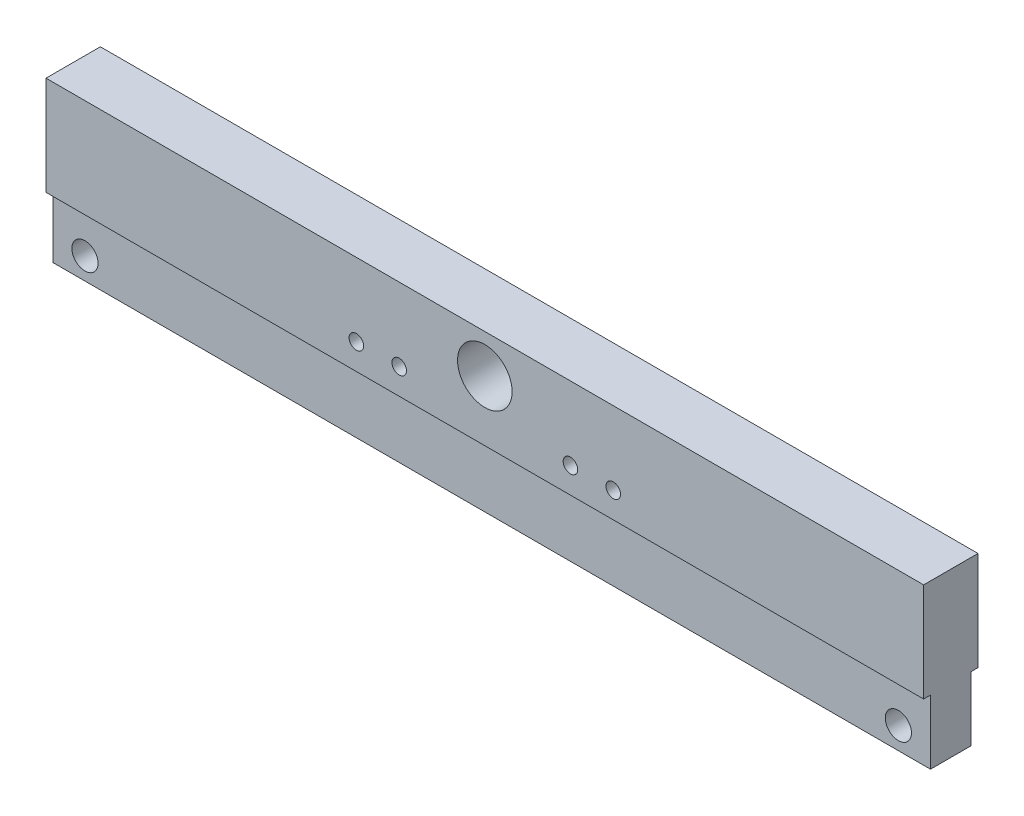
ISO-10303-21;
HEADER;
FILE_DESCRIPTION(('STEP AP214'),'2;1');
FILE_NAME('part.step','',(''),(''),'','','');
FILE_SCHEMA(('AUTOMOTIVE_DESIGN { 1 0 10303 214 1 1 1 1 }'));
ENDSEC;
DATA;
#1=APPLICATION_CONTEXT('core data for automotive mechanical design processes');
#2=APPLICATION_PROTOCOL_DEFINITION('international standard','automotive_design',2000,#1);
#3=PRODUCT_CONTEXT('',#1,'mechanical');
#4=PRODUCT('Part','Part','',(#3));
#5=PRODUCT_RELATED_PRODUCT_CATEGORY('part','',(#4));
#6=PRODUCT_DEFINITION_FORMATION('','',#4);
#7=PRODUCT_DEFINITION_CONTEXT('part definition',#1,'design');
#8=PRODUCT_DEFINITION('design','',#6,#7);
#9=PRODUCT_DEFINITION_SHAPE('','',#8);
#10=(LENGTH_UNIT() NAMED_UNIT(*) SI_UNIT(.MILLI.,.METRE.));
#11=(NAMED_UNIT(*) PLANE_ANGLE_UNIT() SI_UNIT($,.RADIAN.));
#12=(NAMED_UNIT(*) SI_UNIT($,.STERADIAN.) SOLID_ANGLE_UNIT());
#13=UNCERTAINTY_MEASURE_WITH_UNIT(LENGTH_MEASURE(1.E-05),#10,'distance_accuracy_value','');
#14=(GEOMETRIC_REPRESENTATION_CONTEXT(3) GLOBAL_UNCERTAINTY_ASSIGNED_CONTEXT((#13)) GLOBAL_UNIT_ASSIGNED_CONTEXT((#10,
#11,#12)) REPRESENTATION_CONTEXT('',''));
#15=CARTESIAN_POINT('',(0.,0.,0.));
#16=DIRECTION('',(0.,0.,1.));
#17=DIRECTION('',(1.,0.,0.));
#18=AXIS2_PLACEMENT_3D('',#15,#16,#17);
#19=CARTESIAN_POINT('',(0.,0.,12.7));
#20=DIRECTION('',(0.,0.,1.));
#21=DIRECTION('',(1.,0.,0.));
#22=AXIS2_PLACEMENT_3D('',#19,#20,#21);
#23=PLANE('',#22);
#24=CARTESIAN_POINT('',(-60.,3.9,12.7));
#25=DIRECTION('',(0.,0.,1.));
#26=DIRECTION('',(1.,0.,0.));
#27=AXIS2_PLACEMENT_3D('',#24,#25,#26);
#28=CIRCLE('',#27,3.39999999999999);
#29=CARTESIAN_POINT('',(-56.6,3.9,12.7));
#30=VERTEX_POINT('',#29);
#31=EDGE_CURVE('E207',#30,#30,#28,.T.);
#32=ORIENTED_EDGE('',*,*,#31,.F.);
#33=EDGE_LOOP('',(#32));
#34=FACE_BOUND('',#33,.T.);
#35=CARTESIAN_POINT('',(-40.,3.9,12.7));
#36=DIRECTION('',(0.,0.,1.));
#37=DIRECTION('',(1.,0.,0.));
#38=AXIS2_PLACEMENT_3D('',#35,#36,#37);
#39=CIRCLE('',#38,3.39999999999999);
#40=CARTESIAN_POINT('',(-36.6,3.9,12.7));
#41=VERTEX_POINT('',#40);
#42=EDGE_CURVE('E199',#41,#41,#39,.T.);
#43=ORIENTED_EDGE('',*,*,#42,.F.);
#44=EDGE_LOOP('',(#43));
#45=FACE_BOUND('',#44,.T.);
#46=CARTESIAN_POINT('',(40.,3.9,12.7));
#47=DIRECTION('',(0.,0.,1.));
#48=DIRECTION('',(1.,0.,0.));
#49=AXIS2_PLACEMENT_3D('',#46,#47,#48);
#50=CIRCLE('',#49,3.39999999999999);
#51=CARTESIAN_POINT('',(43.4,3.9,12.7));
#52=VERTEX_POINT('',#51);
#53=EDGE_CURVE('E191',#52,#52,#50,.T.);
#54=ORIENTED_EDGE('',*,*,#53,.F.);
#55=EDGE_LOOP('',(#54));
#56=FACE_BOUND('',#55,.T.);
#57=CARTESIAN_POINT('',(60.,3.9,12.7));
#58=DIRECTION('',(0.,0.,1.));
#59=DIRECTION('',(1.,0.,0.));
#60=AXIS2_PLACEMENT_3D('',#57,#58,#59);
#61=CIRCLE('',#60,3.39999999999999);
#62=CARTESIAN_POINT('',(63.4,3.9,12.7));
#63=VERTEX_POINT('',#62);
#64=EDGE_CURVE('E183',#63,#63,#61,.T.);
#65=ORIENTED_EDGE('',*,*,#64,.F.);
#66=EDGE_LOOP('',(#65));
#67=FACE_BOUND('',#66,.T.);
#68=CARTESIAN_POINT('',(0.,20.1,12.7));
#69=DIRECTION('',(0.,0.,1.));
#70=DIRECTION('',(1.,0.,0.));
#71=AXIS2_PLACEMENT_3D('',#68,#69,#70);
#72=CIRCLE('',#71,12.75);
#73=CARTESIAN_POINT('',(12.75,20.1,12.7));
#74=VERTEX_POINT('',#73);
#75=EDGE_CURVE('E226',#74,#74,#72,.T.);
#76=ORIENTED_EDGE('',*,*,#75,.F.);
#77=EDGE_LOOP('',(#76));
#78=FACE_BOUND('',#77,.T.);
#79=DIRECTION('',(0.,-1.,0.));
#80=VECTOR('',#79,1.);
#81=CARTESIAN_POINT('',(-205.,38.1,12.7));
#82=LINE('',#81,#80);
#83=CARTESIAN_POINT('',(-205.,38.1,12.7));
#84=VERTEX_POINT('',#83);
#85=CARTESIAN_POINT('',(-205.,-8.1,12.7));
#86=VERTEX_POINT('',#85);
#87=EDGE_CURVE('E228',#84,#86,#82,.T.);
#88=ORIENTED_EDGE('',*,*,#87,.T.);
#89=DIRECTION('',(1.,0.,0.));
#90=VECTOR('',#89,1.);
#91=CARTESIAN_POINT('',(0.,-8.1,12.7));
#92=LINE('',#91,#90);
#93=CARTESIAN_POINT('',(205.,-8.1,12.7));
#94=VERTEX_POINT('',#93);
#95=EDGE_CURVE('E144',#86,#94,#92,.T.);
#96=ORIENTED_EDGE('',*,*,#95,.T.);
#97=DIRECTION('',(0.,1.,0.));
#98=VECTOR('',#97,1.);
#99=CARTESIAN_POINT('',(205.,38.1,12.7));
#100=LINE('',#99,#98);
#101=CARTESIAN_POINT('',(205.,38.1,12.7));
#102=VERTEX_POINT('',#101);
#103=EDGE_CURVE('E233',#94,#102,#100,.T.);
#104=ORIENTED_EDGE('',*,*,#103,.T.);
#105=DIRECTION('',(-1.,0.,0.));
#106=VECTOR('',#105,1.);
#107=CARTESIAN_POINT('',(-205.,38.1,12.7));
#108=LINE('',#107,#106);
#109=EDGE_CURVE('E230',#102,#84,#108,.T.);
#110=ORIENTED_EDGE('',*,*,#109,.T.);
#111=EDGE_LOOP('',(#88,#96,#104,#110));
#112=FACE_BOUND('',#111,.T.);
#113=ADVANCED_FACE('F43',(#34,#45,#56,#67,#78,#112),#23,.T.);
#114=CARTESIAN_POINT('',(0.,0.,-12.7));
#115=DIRECTION('',(0.,0.,1.));
#116=DIRECTION('',(1.,0.,0.));
#117=AXIS2_PLACEMENT_3D('',#114,#115,#116);
#118=PLANE('',#117);
#119=CARTESIAN_POINT('',(-60.,3.9,-12.7));
#120=DIRECTION('',(0.,0.,1.));
#121=DIRECTION('',(1.,0.,0.));
#122=AXIS2_PLACEMENT_3D('',#119,#120,#121);
#123=CIRCLE('',#122,3.39999999999999);
#124=CARTESIAN_POINT('',(-56.6,3.9,-12.7));
#125=VERTEX_POINT('',#124);
#126=EDGE_CURVE('E203',#125,#125,#123,.T.);
#127=ORIENTED_EDGE('',*,*,#126,.T.);
#128=EDGE_LOOP('',(#127));
#129=FACE_BOUND('',#128,.T.);
#130=CARTESIAN_POINT('',(-40.,3.9,-12.7));
#131=DIRECTION('',(0.,0.,1.));
#132=DIRECTION('',(1.,0.,0.));
#133=AXIS2_PLACEMENT_3D('',#130,#131,#132);
#134=CIRCLE('',#133,3.39999999999999);
#135=CARTESIAN_POINT('',(-36.6,3.9,-12.7));
#136=VERTEX_POINT('',#135);
#137=EDGE_CURVE('E195',#136,#136,#134,.T.);
#138=ORIENTED_EDGE('',*,*,#137,.T.);
#139=EDGE_LOOP('',(#138));
#140=FACE_BOUND('',#139,.T.);
#141=CARTESIAN_POINT('',(40.,3.9,-12.7));
#142=DIRECTION('',(0.,0.,1.));
#143=DIRECTION('',(1.,0.,0.));
#144=AXIS2_PLACEMENT_3D('',#141,#142,#143);
#145=CIRCLE('',#144,3.39999999999999);
#146=CARTESIAN_POINT('',(43.4,3.9,-12.7));
#147=VERTEX_POINT('',#146);
#148=EDGE_CURVE('E187',#147,#147,#145,.T.);
#149=ORIENTED_EDGE('',*,*,#148,.T.);
#150=EDGE_LOOP('',(#149));
#151=FACE_BOUND('',#150,.T.);
#152=CARTESIAN_POINT('',(60.,3.9,-12.7));
#153=DIRECTION('',(0.,0.,1.));
#154=DIRECTION('',(1.,0.,0.));
#155=AXIS2_PLACEMENT_3D('',#152,#153,#154);
#156=CIRCLE('',#155,3.4);
#157=CARTESIAN_POINT('',(63.4,3.9,-12.7));
#158=VERTEX_POINT('',#157);
#159=EDGE_CURVE('E177',#158,#158,#156,.T.);
#160=ORIENTED_EDGE('',*,*,#159,.T.);
#161=EDGE_LOOP('',(#160));
#162=FACE_BOUND('',#161,.T.);
#163=CARTESIAN_POINT('',(0.,20.1,-12.7));
#164=DIRECTION('',(0.,0.,1.));
#165=DIRECTION('',(1.,0.,0.));
#166=AXIS2_PLACEMENT_3D('',#163,#164,#165);
#167=CIRCLE('',#166,12.75);
#168=CARTESIAN_POINT('',(12.75,20.1,-12.7));
#169=VERTEX_POINT('',#168);
#170=EDGE_CURVE('E242',#169,#169,#167,.T.);
#171=ORIENTED_EDGE('',*,*,#170,.T.);
#172=EDGE_LOOP('',(#171));
#173=FACE_BOUND('',#172,.T.);
#174=DIRECTION('',(1.,0.,0.));
#175=VECTOR('',#174,1.);
#176=CARTESIAN_POINT('',(0.,-8.1,-12.7));
#177=LINE('',#176,#175);
#178=CARTESIAN_POINT('',(-205.,-8.1,-12.7));
#179=VERTEX_POINT('',#178);
#180=CARTESIAN_POINT('',(205.,-8.1,-12.7));
#181=VERTEX_POINT('',#180);
#182=EDGE_CURVE('E133',#179,#181,#177,.T.);
#183=ORIENTED_EDGE('',*,*,#182,.F.);
#184=DIRECTION('',(0.,-1.,0.));
#185=VECTOR('',#184,1.);
#186=CARTESIAN_POINT('',(-205.,38.1,-12.7));
#187=LINE('',#186,#185);
#188=CARTESIAN_POINT('',(-205.,38.1,-12.7));
#189=VERTEX_POINT('',#188);
#190=EDGE_CURVE('E130',#189,#179,#187,.T.);
#191=ORIENTED_EDGE('',*,*,#190,.F.);
#192=DIRECTION('',(-1.,0.,0.));
#193=VECTOR('',#192,1.);
#194=CARTESIAN_POINT('',(-205.,38.1,-12.7));
#195=LINE('',#194,#193);
#196=CARTESIAN_POINT('',(205.,38.1,-12.7));
#197=VERTEX_POINT('',#196);
#198=EDGE_CURVE('E234',#197,#189,#195,.T.);
#199=ORIENTED_EDGE('',*,*,#198,.F.);
#200=DIRECTION('',(0.,1.,0.));
#201=VECTOR('',#200,1.);
#202=CARTESIAN_POINT('',(205.,38.1,-12.7));
#203=LINE('',#202,#201);
#204=EDGE_CURVE('E239',#181,#197,#203,.T.);
#205=ORIENTED_EDGE('',*,*,#204,.F.);
#206=EDGE_LOOP('',(#183,#191,#199,#205));
#207=FACE_BOUND('',#206,.T.);
#208=ADVANCED_FACE('F216',(#129,#140,#151,#162,#173,#207),#118,.F.);
#209=CARTESIAN_POINT('',(-205.,38.1,12.7));
#210=DIRECTION('',(1.,0.,0.));
#211=DIRECTION('',(0.,0.,-1.));
#212=AXIS2_PLACEMENT_3D('',#209,#210,#211);
#213=PLANE('',#212);
#214=DIRECTION('',(0.,-1.,0.));
#215=VECTOR('',#214,1.);
#216=CARTESIAN_POINT('',(-205.,-8.1,9.50000000000001));
#217=LINE('',#216,#215);
#218=CARTESIAN_POINT('',(-205.,-8.1,9.50000000000001));
#219=VERTEX_POINT('',#218);
#220=CARTESIAN_POINT('',(-205.,-38.1,9.50000000000001));
#221=VERTEX_POINT('',#220);
#222=EDGE_CURVE('E170',#219,#221,#217,.T.);
#223=ORIENTED_EDGE('',*,*,#222,.F.);
#224=DIRECTION('',(0.,0.,-1.));
#225=VECTOR('',#224,1.);
#226=CARTESIAN_POINT('',(-205.,-8.1,12.7));
#227=LINE('',#226,#225);
#228=EDGE_CURVE('E135',#86,#219,#227,.T.);
#229=ORIENTED_EDGE('',*,*,#228,.F.);
#230=ORIENTED_EDGE('',*,*,#87,.F.);
#231=DIRECTION('',(0.,0.,-1.));
#232=VECTOR('',#231,1.);
#233=CARTESIAN_POINT('',(-205.,38.1,12.7));
#234=LINE('',#233,#232);
#235=EDGE_CURVE('E247',#84,#189,#234,.T.);
#236=ORIENTED_EDGE('',*,*,#235,.T.);
#237=ORIENTED_EDGE('',*,*,#190,.T.);
#238=CARTESIAN_POINT('',(-205.,-8.1,-9.49999999999999));
#239=VERTEX_POINT('',#238);
#240=EDGE_CURVE('E120',#239,#179,#227,.T.);
#241=ORIENTED_EDGE('',*,*,#240,.F.);
#242=DIRECTION('',(0.,-1.,0.));
#243=VECTOR('',#242,1.);
#244=CARTESIAN_POINT('',(-205.,-8.1,-9.49999999999999));
#245=LINE('',#244,#243);
#246=CARTESIAN_POINT('',(-205.,-38.1,-9.49999999999999));
#247=VERTEX_POINT('',#246);
#248=EDGE_CURVE('E106',#239,#247,#245,.T.);
#249=ORIENTED_EDGE('',*,*,#248,.T.);
#250=DIRECTION('',(0.,0.,-1.));
#251=VECTOR('',#250,1.);
#252=CARTESIAN_POINT('',(-205.,-38.1,12.7));
#253=LINE('',#252,#251);
#254=EDGE_CURVE('E262',#221,#247,#253,.T.);
#255=ORIENTED_EDGE('',*,*,#254,.F.);
#256=EDGE_LOOP('',(#223,#229,#230,#236,#237,#241,#249,#255));
#257=FACE_BOUND('',#256,.T.);
#258=ADVANCED_FACE('F45',(#257),#213,.F.);
#259=CARTESIAN_POINT('',(-205.,-38.1,12.7));
#260=DIRECTION('',(0.,1.,0.));
#261=DIRECTION('',(0.,0.,1.));
#262=AXIS2_PLACEMENT_3D('',#259,#260,#261);
#263=PLANE('',#262);
#264=CARTESIAN_POINT('',(165.,-38.1,0.));
#265=DIRECTION('',(0.,-1.,0.));
#266=DIRECTION('',(0.,0.,1.));
#267=AXIS2_PLACEMENT_3D('',#264,#265,#266);
#268=CIRCLE('',#267,6.00000000000002);
#269=CARTESIAN_POINT('',(165.,-38.1,6.00000000000001));
#270=VERTEX_POINT('',#269);
#271=EDGE_CURVE('E132',#270,#270,#268,.T.);
#272=ORIENTED_EDGE('',*,*,#271,.F.);
#273=EDGE_LOOP('',(#272));
#274=FACE_BOUND('',#273,.T.);
#275=CARTESIAN_POINT('',(-165.,-38.1,0.));
#276=DIRECTION('',(0.,-1.,0.));
#277=DIRECTION('',(0.,0.,-1.));
#278=AXIS2_PLACEMENT_3D('',#275,#276,#277);
#279=CIRCLE('',#278,6.00000000000002);
#280=CARTESIAN_POINT('',(-165.,-38.1,-6.00000000000002));
#281=VERTEX_POINT('',#280);
#282=EDGE_CURVE('E347',#281,#281,#279,.T.);
#283=ORIENTED_EDGE('',*,*,#282,.F.);
#284=EDGE_LOOP('',(#283));
#285=FACE_BOUND('',#284,.T.);
#286=CARTESIAN_POINT('',(0.,-38.1,0.));
#287=DIRECTION('',(0.,-1.,0.));
#288=DIRECTION('',(0.,0.,-1.));
#289=AXIS2_PLACEMENT_3D('',#286,#287,#288);
#290=CIRCLE('',#289,6.);
#291=CARTESIAN_POINT('',(0.,-38.1,-5.99999999999999));
#292=VERTEX_POINT('',#291);
#293=EDGE_CURVE('E351',#292,#292,#290,.T.);
#294=ORIENTED_EDGE('',*,*,#293,.F.);
#295=EDGE_LOOP('',(#294));
#296=FACE_BOUND('',#295,.T.);
#297=DIRECTION('',(-1.,0.,0.));
#298=VECTOR('',#297,1.);
#299=CARTESIAN_POINT('',(205.,-38.1,9.50000000000001));
#300=LINE('',#299,#298);
#301=CARTESIAN_POINT('',(205.,-38.1,9.50000000000001));
#302=VERTEX_POINT('',#301);
#303=EDGE_CURVE('E66',#302,#221,#300,.T.);
#304=ORIENTED_EDGE('',*,*,#303,.T.);
#305=ORIENTED_EDGE('',*,*,#254,.T.);
#306=DIRECTION('',(1.,0.,0.));
#307=VECTOR('',#306,1.);
#308=CARTESIAN_POINT('',(205.,-38.1,-9.49999999999999));
#309=LINE('',#308,#307);
#310=CARTESIAN_POINT('',(205.,-38.1,-9.49999999999999));
#311=VERTEX_POINT('',#310);
#312=EDGE_CURVE('E109',#247,#311,#309,.T.);
#313=ORIENTED_EDGE('',*,*,#312,.T.);
#314=DIRECTION('',(0.,0.,-1.));
#315=VECTOR('',#314,1.);
#316=CARTESIAN_POINT('',(205.,-38.1,12.7));
#317=LINE('',#316,#315);
#318=EDGE_CURVE('E258',#302,#311,#317,.T.);
#319=ORIENTED_EDGE('',*,*,#318,.F.);
#320=EDGE_LOOP('',(#304,#305,#313,#319));
#321=FACE_BOUND('',#320,.T.);
#322=ADVANCED_FACE('F335',(#274,#285,#296,#321),#263,.F.);
#323=CARTESIAN_POINT('',(205.,38.1,12.7));
#324=DIRECTION('',(-1.,0.,0.));
#325=DIRECTION('',(0.,0.,1.));
#326=AXIS2_PLACEMENT_3D('',#323,#324,#325);
#327=PLANE('',#326);
#328=DIRECTION('',(0.,-1.,0.));
#329=VECTOR('',#328,1.);
#330=CARTESIAN_POINT('',(205.,-8.1,9.50000000000001));
#331=LINE('',#330,#329);
#332=CARTESIAN_POINT('',(205.,-8.1,9.50000000000001));
#333=VERTEX_POINT('',#332);
#334=EDGE_CURVE('E167',#333,#302,#331,.T.);
#335=ORIENTED_EDGE('',*,*,#334,.T.);
#336=ORIENTED_EDGE('',*,*,#318,.T.);
#337=DIRECTION('',(0.,-1.,0.));
#338=VECTOR('',#337,1.);
#339=CARTESIAN_POINT('',(205.,-8.1,-9.49999999999999));
#340=LINE('',#339,#338);
#341=CARTESIAN_POINT('',(205.,-8.1,-9.49999999999999));
#342=VERTEX_POINT('',#341);
#343=EDGE_CURVE('E115',#342,#311,#340,.T.);
#344=ORIENTED_EDGE('',*,*,#343,.F.);
#345=DIRECTION('',(0.,0.,1.));
#346=VECTOR('',#345,1.);
#347=CARTESIAN_POINT('',(205.,-8.1,12.7));
#348=LINE('',#347,#346);
#349=EDGE_CURVE('E12',#181,#342,#348,.T.);
#350=ORIENTED_EDGE('',*,*,#349,.F.);
#351=ORIENTED_EDGE('',*,*,#204,.T.);
#352=DIRECTION('',(0.,0.,-1.));
#353=VECTOR('',#352,1.);
#354=CARTESIAN_POINT('',(205.,38.1,12.7));
#355=LINE('',#354,#353);
#356=EDGE_CURVE('E254',#102,#197,#355,.T.);
#357=ORIENTED_EDGE('',*,*,#356,.F.);
#358=ORIENTED_EDGE('',*,*,#103,.F.);
#359=EDGE_CURVE('E52',#333,#94,#348,.T.);
#360=ORIENTED_EDGE('',*,*,#359,.F.);
#361=EDGE_LOOP('',(#335,#336,#344,#350,#351,#357,#358,#360));
#362=FACE_BOUND('',#361,.T.);
#363=ADVANCED_FACE('F332',(#362),#327,.F.);
#364=CARTESIAN_POINT('',(-205.,38.1,12.7));
#365=DIRECTION('',(0.,-1.,0.));
#366=DIRECTION('',(0.,0.,-1.));
#367=AXIS2_PLACEMENT_3D('',#364,#365,#366);
#368=PLANE('',#367);
#369=ORIENTED_EDGE('',*,*,#198,.T.);
#370=ORIENTED_EDGE('',*,*,#235,.F.);
#371=ORIENTED_EDGE('',*,*,#109,.F.);
#372=ORIENTED_EDGE('',*,*,#356,.T.);
#373=EDGE_LOOP('',(#369,#370,#371,#372));
#374=FACE_BOUND('',#373,.T.);
#375=ADVANCED_FACE('F324',(#374),#368,.F.);
#376=CARTESIAN_POINT('',(0.,20.1,12.7));
#377=DIRECTION('',(0.,0.,-1.));
#378=DIRECTION('',(-1.,0.,0.));
#379=AXIS2_PLACEMENT_3D('',#376,#377,#378);
#380=CYLINDRICAL_SURFACE('',#379,12.75);
#381=ORIENTED_EDGE('',*,*,#75,.T.);
#382=EDGE_LOOP('',(#381));
#383=FACE_BOUND('',#382,.T.);
#384=ORIENTED_EDGE('',*,*,#170,.F.);
#385=EDGE_LOOP('',(#384));
#386=FACE_BOUND('',#385,.T.);
#387=ADVANCED_FACE('F318',(#383,#386),#380,.F.);
#388=CARTESIAN_POINT('',(0.,-23.1,0.));
#389=DIRECTION('',(0.,-1.,0.));
#390=DIRECTION('',(0.,0.,-1.));
#391=AXIS2_PLACEMENT_3D('',#388,#389,#390);
#392=CYLINDRICAL_SURFACE('',#391,6.);
#393=CARTESIAN_POINT('',(0.,-23.1,0.));
#394=DIRECTION('',(0.,-1.,0.));
#395=DIRECTION('',(0.,0.,-1.));
#396=AXIS2_PLACEMENT_3D('',#393,#394,#395);
#397=CIRCLE('',#396,6.);
#398=CARTESIAN_POINT('',(0.,-23.1,-5.99999999999999));
#399=VERTEX_POINT('',#398);
#400=EDGE_CURVE('E361',#399,#399,#397,.T.);
#401=ORIENTED_EDGE('',*,*,#400,.F.);
#402=EDGE_LOOP('',(#401));
#403=FACE_BOUND('',#402,.T.);
#404=ORIENTED_EDGE('',*,*,#293,.T.);
#405=EDGE_LOOP('',(#404));
#406=FACE_BOUND('',#405,.T.);
#407=ADVANCED_FACE('F314',(#403,#406),#392,.F.);
#408=CARTESIAN_POINT('',(0.,-23.1,0.));
#409=DIRECTION('',(0.,-1.,0.));
#410=DIRECTION('',(0.,0.,-1.));
#411=AXIS2_PLACEMENT_3D('',#408,#409,#410);
#412=PLANE('',#411);
#413=ORIENTED_EDGE('',*,*,#400,.T.);
#414=EDGE_LOOP('',(#413));
#415=FACE_BOUND('',#414,.T.);
#416=ADVANCED_FACE('F304',(#415),#412,.T.);
#417=CARTESIAN_POINT('',(-165.,-23.1,0.));
#418=DIRECTION('',(0.,-1.,0.));
#419=DIRECTION('',(0.,0.,-1.));
#420=AXIS2_PLACEMENT_3D('',#417,#418,#419);
#421=CYLINDRICAL_SURFACE('',#420,6.00000000000002);
#422=CARTESIAN_POINT('',(-165.,-23.1,0.));
#423=DIRECTION('',(0.,-1.,0.));
#424=DIRECTION('',(0.,0.,-1.));
#425=AXIS2_PLACEMENT_3D('',#422,#423,#424);
#426=CIRCLE('',#425,6.00000000000002);
#427=CARTESIAN_POINT('',(-165.,-23.1,-6.00000000000002));
#428=VERTEX_POINT('',#427);
#429=EDGE_CURVE('E362',#428,#428,#426,.T.);
#430=ORIENTED_EDGE('',*,*,#429,.F.);
#431=EDGE_LOOP('',(#430));
#432=FACE_BOUND('',#431,.T.);
#433=ORIENTED_EDGE('',*,*,#282,.T.);
#434=EDGE_LOOP('',(#433));
#435=FACE_BOUND('',#434,.T.);
#436=ADVANCED_FACE('F300',(#432,#435),#421,.F.);
#437=CARTESIAN_POINT('',(-165.,-23.1,0.));
#438=DIRECTION('',(0.,-1.,0.));
#439=DIRECTION('',(0.,0.,-1.));
#440=AXIS2_PLACEMENT_3D('',#437,#438,#439);
#441=PLANE('',#440);
#442=ORIENTED_EDGE('',*,*,#429,.T.);
#443=EDGE_LOOP('',(#442));
#444=FACE_BOUND('',#443,.T.);
#445=ADVANCED_FACE('F296',(#444),#441,.T.);
#446=CARTESIAN_POINT('',(165.,-23.1,0.));
#447=DIRECTION('',(0.,-1.,0.));
#448=DIRECTION('',(0.,0.,-1.));
#449=AXIS2_PLACEMENT_3D('',#446,#447,#448);
#450=CYLINDRICAL_SURFACE('',#449,6.00000000000002);
#451=CARTESIAN_POINT('',(165.,-23.1,0.));
#452=DIRECTION('',(0.,-1.,0.));
#453=DIRECTION('',(0.,0.,1.));
#454=AXIS2_PLACEMENT_3D('',#451,#452,#453);
#455=CIRCLE('',#454,6.00000000000002);
#456=CARTESIAN_POINT('',(165.,-23.1,6.00000000000001));
#457=VERTEX_POINT('',#456);
#458=EDGE_CURVE('E139',#457,#457,#455,.T.);
#459=ORIENTED_EDGE('',*,*,#458,.F.);
#460=EDGE_LOOP('',(#459));
#461=FACE_BOUND('',#460,.T.);
#462=ORIENTED_EDGE('',*,*,#271,.T.);
#463=EDGE_LOOP('',(#462));
#464=FACE_BOUND('',#463,.T.);
#465=ADVANCED_FACE('F299',(#461,#464),#450,.F.);
#466=CARTESIAN_POINT('',(165.,-23.1,0.));
#467=DIRECTION('',(0.,1.,0.));
#468=DIRECTION('',(0.,0.,1.));
#469=AXIS2_PLACEMENT_3D('',#466,#467,#468);
#470=PLANE('',#469);
#471=ORIENTED_EDGE('',*,*,#458,.T.);
#472=EDGE_LOOP('',(#471));
#473=FACE_BOUND('',#472,.T.);
#474=ADVANCED_FACE('F292',(#473),#470,.F.);
#475=CARTESIAN_POINT('',(205.,-8.1,-9.49999999999999));
#476=DIRECTION('',(0.,0.,-1.));
#477=DIRECTION('',(-1.,0.,0.));
#478=AXIS2_PLACEMENT_3D('',#475,#476,#477);
#479=PLANE('',#478);
#480=CARTESIAN_POINT('',(190.,-27.9,-9.49999999999999));
#481=DIRECTION('',(0.,0.,-1.));
#482=DIRECTION('',(-1.,0.,0.));
#483=AXIS2_PLACEMENT_3D('',#480,#481,#482);
#484=CIRCLE('',#483,6.12499999999999);
#485=CARTESIAN_POINT('',(183.875,-27.9,-9.49999999999999));
#486=VERTEX_POINT('',#485);
#487=EDGE_CURVE('E160',#486,#486,#484,.T.);
#488=ORIENTED_EDGE('',*,*,#487,.F.);
#489=EDGE_LOOP('',(#488));
#490=FACE_BOUND('',#489,.T.);
#491=CARTESIAN_POINT('',(-190.,-27.9,-9.49999999999999));
#492=DIRECTION('',(0.,0.,-1.));
#493=DIRECTION('',(-1.,0.,0.));
#494=AXIS2_PLACEMENT_3D('',#491,#492,#493);
#495=CIRCLE('',#494,6.12499999999999);
#496=CARTESIAN_POINT('',(-196.125,-27.9,-9.49999999999999));
#497=VERTEX_POINT('',#496);
#498=EDGE_CURVE('E163',#497,#497,#495,.T.);
#499=ORIENTED_EDGE('',*,*,#498,.F.);
#500=EDGE_LOOP('',(#499));
#501=FACE_BOUND('',#500,.T.);
#502=ORIENTED_EDGE('',*,*,#312,.F.);
#503=ORIENTED_EDGE('',*,*,#248,.F.);
#504=DIRECTION('',(1.,0.,0.));
#505=VECTOR('',#504,1.);
#506=CARTESIAN_POINT('',(205.,-8.1,-9.49999999999999));
#507=LINE('',#506,#505);
#508=EDGE_CURVE('E59',#239,#342,#507,.T.);
#509=ORIENTED_EDGE('',*,*,#508,.T.);
#510=ORIENTED_EDGE('',*,*,#343,.T.);
#511=EDGE_LOOP('',(#502,#503,#509,#510));
#512=FACE_BOUND('',#511,.T.);
#513=ADVANCED_FACE('F107',(#490,#501,#512),#479,.T.);
#514=CARTESIAN_POINT('',(0.,-8.1,0.));
#515=DIRECTION('',(0.,-1.,0.));
#516=DIRECTION('',(0.,0.,-1.));
#517=AXIS2_PLACEMENT_3D('',#514,#515,#516);
#518=PLANE('',#517);
#519=ORIENTED_EDGE('',*,*,#240,.T.);
#520=ORIENTED_EDGE('',*,*,#182,.T.);
#521=ORIENTED_EDGE('',*,*,#349,.T.);
#522=ORIENTED_EDGE('',*,*,#508,.F.);
#523=EDGE_LOOP('',(#519,#520,#521,#522));
#524=FACE_BOUND('',#523,.T.);
#525=ADVANCED_FACE('F119',(#524),#518,.T.);
#526=ORIENTED_EDGE('',*,*,#228,.T.);
#527=DIRECTION('',(-1.,0.,0.));
#528=VECTOR('',#527,1.);
#529=CARTESIAN_POINT('',(205.,-8.1,9.50000000000001));
#530=LINE('',#529,#528);
#531=EDGE_CURVE('E116',#333,#219,#530,.T.);
#532=ORIENTED_EDGE('',*,*,#531,.F.);
#533=ORIENTED_EDGE('',*,*,#359,.T.);
#534=ORIENTED_EDGE('',*,*,#95,.F.);
#535=EDGE_LOOP('',(#526,#532,#533,#534));
#536=FACE_BOUND('',#535,.T.);
#537=ADVANCED_FACE('F276',(#536),#518,.T.);
#538=CARTESIAN_POINT('',(205.,-8.1,9.50000000000001));
#539=DIRECTION('',(0.,0.,1.));
#540=DIRECTION('',(1.,0.,0.));
#541=AXIS2_PLACEMENT_3D('',#538,#539,#540);
#542=PLANE('',#541);
#543=CARTESIAN_POINT('',(190.,-27.9,9.50000000000001));
#544=DIRECTION('',(0.,0.,1.));
#545=DIRECTION('',(1.,0.,0.));
#546=AXIS2_PLACEMENT_3D('',#543,#544,#545);
#547=CIRCLE('',#546,6.12499999999999);
#548=CARTESIAN_POINT('',(196.125,-27.9,9.50000000000001));
#549=VERTEX_POINT('',#548);
#550=EDGE_CURVE('E151',#549,#549,#547,.T.);
#551=ORIENTED_EDGE('',*,*,#550,.F.);
#552=EDGE_LOOP('',(#551));
#553=FACE_BOUND('',#552,.T.);
#554=CARTESIAN_POINT('',(-190.,-27.9,9.50000000000001));
#555=DIRECTION('',(0.,0.,1.));
#556=DIRECTION('',(1.,0.,0.));
#557=AXIS2_PLACEMENT_3D('',#554,#555,#556);
#558=CIRCLE('',#557,6.12499999999999);
#559=CARTESIAN_POINT('',(-183.875,-27.9,9.50000000000001));
#560=VERTEX_POINT('',#559);
#561=EDGE_CURVE('E157',#560,#560,#558,.T.);
#562=ORIENTED_EDGE('',*,*,#561,.F.);
#563=EDGE_LOOP('',(#562));
#564=FACE_BOUND('',#563,.T.);
#565=ORIENTED_EDGE('',*,*,#303,.F.);
#566=ORIENTED_EDGE('',*,*,#334,.F.);
#567=ORIENTED_EDGE('',*,*,#531,.T.);
#568=ORIENTED_EDGE('',*,*,#222,.T.);
#569=EDGE_LOOP('',(#565,#566,#567,#568));
#570=FACE_BOUND('',#569,.T.);
#571=ADVANCED_FACE('F273',(#553,#564,#570),#542,.T.);
#572=CARTESIAN_POINT('',(190.,-27.9,12.7));
#573=DIRECTION('',(0.,0.,-1.));
#574=DIRECTION('',(-1.,0.,0.));
#575=AXIS2_PLACEMENT_3D('',#572,#573,#574);
#576=CYLINDRICAL_SURFACE('',#575,6.12499999999999);
#577=ORIENTED_EDGE('',*,*,#487,.T.);
#578=EDGE_LOOP('',(#577));
#579=FACE_BOUND('',#578,.T.);
#580=ORIENTED_EDGE('',*,*,#550,.T.);
#581=EDGE_LOOP('',(#580));
#582=FACE_BOUND('',#581,.T.);
#583=ADVANCED_FACE('F275',(#579,#582),#576,.F.);
#584=CARTESIAN_POINT('',(-190.,-27.9,12.7));
#585=DIRECTION('',(0.,0.,-1.));
#586=DIRECTION('',(-1.,0.,0.));
#587=AXIS2_PLACEMENT_3D('',#584,#585,#586);
#588=CYLINDRICAL_SURFACE('',#587,6.12499999999999);
#589=ORIENTED_EDGE('',*,*,#498,.T.);
#590=EDGE_LOOP('',(#589));
#591=FACE_BOUND('',#590,.T.);
#592=ORIENTED_EDGE('',*,*,#561,.T.);
#593=EDGE_LOOP('',(#592));
#594=FACE_BOUND('',#593,.T.);
#595=ADVANCED_FACE('F271',(#591,#594),#588,.F.);
#596=CARTESIAN_POINT('',(60.,3.9,12.7));
#597=DIRECTION('',(0.,0.,1.));
#598=DIRECTION('',(1.,0.,0.));
#599=AXIS2_PLACEMENT_3D('',#596,#597,#598);
#600=CYLINDRICAL_SURFACE('',#599,3.39999999999999);
#601=ORIENTED_EDGE('',*,*,#159,.F.);
#602=EDGE_LOOP('',(#601));
#603=FACE_BOUND('',#602,.T.);
#604=ORIENTED_EDGE('',*,*,#64,.T.);
#605=EDGE_LOOP('',(#604));
#606=FACE_BOUND('',#605,.T.);
#607=ADVANCED_FACE('F289',(#603,#606),#600,.F.);
#608=CARTESIAN_POINT('',(40.,3.9,12.7));
#609=DIRECTION('',(0.,0.,1.));
#610=DIRECTION('',(1.,0.,0.));
#611=AXIS2_PLACEMENT_3D('',#608,#609,#610);
#612=CYLINDRICAL_SURFACE('',#611,3.39999999999999);
#613=ORIENTED_EDGE('',*,*,#148,.F.);
#614=EDGE_LOOP('',(#613));
#615=FACE_BOUND('',#614,.T.);
#616=ORIENTED_EDGE('',*,*,#53,.T.);
#617=EDGE_LOOP('',(#616));
#618=FACE_BOUND('',#617,.T.);
#619=ADVANCED_FACE('F418',(#615,#618),#612,.F.);
#620=CARTESIAN_POINT('',(-40.,3.9,12.7));
#621=DIRECTION('',(0.,0.,1.));
#622=DIRECTION('',(1.,0.,0.));
#623=AXIS2_PLACEMENT_3D('',#620,#621,#622);
#624=CYLINDRICAL_SURFACE('',#623,3.39999999999999);
#625=ORIENTED_EDGE('',*,*,#137,.F.);
#626=EDGE_LOOP('',(#625));
#627=FACE_BOUND('',#626,.T.);
#628=ORIENTED_EDGE('',*,*,#42,.T.);
#629=EDGE_LOOP('',(#628));
#630=FACE_BOUND('',#629,.T.);
#631=ADVANCED_FACE('F408',(#627,#630),#624,.F.);
#632=CARTESIAN_POINT('',(-60.,3.9,12.7));
#633=DIRECTION('',(0.,0.,1.));
#634=DIRECTION('',(1.,0.,0.));
#635=AXIS2_PLACEMENT_3D('',#632,#633,#634);
#636=CYLINDRICAL_SURFACE('',#635,3.39999999999999);
#637=ORIENTED_EDGE('',*,*,#126,.F.);
#638=EDGE_LOOP('',(#637));
#639=FACE_BOUND('',#638,.T.);
#640=ORIENTED_EDGE('',*,*,#31,.T.);
#641=EDGE_LOOP('',(#640));
#642=FACE_BOUND('',#641,.T.);
#643=ADVANCED_FACE('F212',(#639,#642),#636,.F.);
#644=CLOSED_SHELL('',(#113,#208,#258,#322,#363,#375,#387,#407,#416,#436,#445,#465,#474,#513,
#525,#537,#571,#583,#595,#607,#619,#631,#643));
#645=MANIFOLD_SOLID_BREP('B2',#644);
#646=ADVANCED_BREP_SHAPE_REPRESENTATION('',(#18,#645),#14);
#647=SHAPE_DEFINITION_REPRESENTATION(#9,#646);
ENDSEC;
END-ISO-10303-21;
